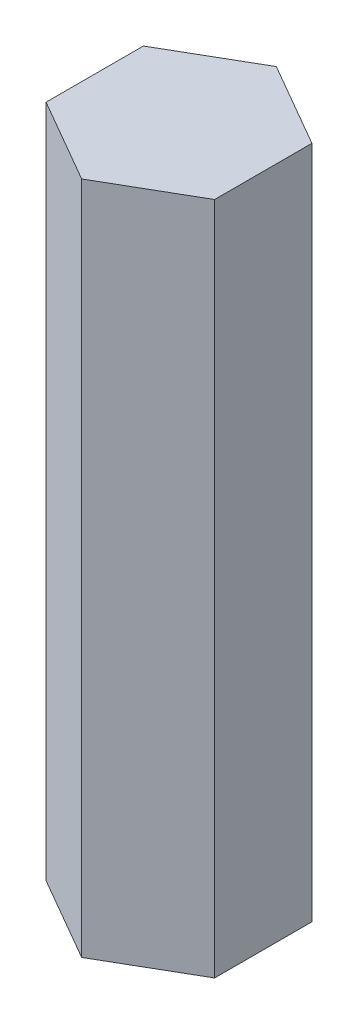
ISO-10303-21;
HEADER;
FILE_DESCRIPTION(('STEP AP214'),'2;1');
FILE_NAME('part.step','',(''),(''),'','','');
FILE_SCHEMA(('AUTOMOTIVE_DESIGN { 1 0 10303 214 1 1 1 1 }'));
ENDSEC;
DATA;
#1=APPLICATION_CONTEXT('core data for automotive mechanical design processes');
#2=APPLICATION_PROTOCOL_DEFINITION('international standard','automotive_design',2000,#1);
#3=PRODUCT_CONTEXT('',#1,'mechanical');
#4=PRODUCT('Part','Part','',(#3));
#5=PRODUCT_RELATED_PRODUCT_CATEGORY('part','',(#4));
#6=PRODUCT_DEFINITION_FORMATION('','',#4);
#7=PRODUCT_DEFINITION_CONTEXT('part definition',#1,'design');
#8=PRODUCT_DEFINITION('design','',#6,#7);
#9=PRODUCT_DEFINITION_SHAPE('','',#8);
#10=(LENGTH_UNIT() NAMED_UNIT(*) SI_UNIT(.MILLI.,.METRE.));
#11=(NAMED_UNIT(*) PLANE_ANGLE_UNIT() SI_UNIT($,.RADIAN.));
#12=(NAMED_UNIT(*) SI_UNIT($,.STERADIAN.) SOLID_ANGLE_UNIT());
#13=UNCERTAINTY_MEASURE_WITH_UNIT(LENGTH_MEASURE(1.E-05),#10,'distance_accuracy_value','');
#14=(GEOMETRIC_REPRESENTATION_CONTEXT(3) GLOBAL_UNCERTAINTY_ASSIGNED_CONTEXT((#13)) GLOBAL_UNIT_ASSIGNED_CONTEXT((#10,
#11,#12)) REPRESENTATION_CONTEXT('',''));
#15=CARTESIAN_POINT('',(0.,0.,0.));
#16=DIRECTION('',(0.,0.,1.));
#17=DIRECTION('',(1.,0.,0.));
#18=AXIS2_PLACEMENT_3D('',#15,#16,#17);
#19=CARTESIAN_POINT('',(6.34999999999995,50.8,-3.66617420935419));
#20=DIRECTION('',(-0.499999999999995,0.,0.866025403784441));
#21=DIRECTION('',(0.866025403784441,0.,0.499999999999995));
#22=AXIS2_PLACEMENT_3D('',#19,#20,#21);
#23=PLANE('',#22);
#24=DIRECTION('',(-0.866025403784441,0.,-0.499999999999995));
#25=VECTOR('',#24,1.);
#26=CARTESIAN_POINT('',(6.34999999999995,0.,-3.66617420935419));
#27=LINE('',#26,#25);
#28=CARTESIAN_POINT('',(6.34999999999995,0.,-3.66617420935419));
#29=VERTEX_POINT('',#28);
#30=CARTESIAN_POINT('',(0.,0.,-7.33234841870824));
#31=VERTEX_POINT('',#30);
#32=EDGE_CURVE('E121',#29,#31,#27,.T.);
#33=ORIENTED_EDGE('',*,*,#32,.T.);
#34=DIRECTION('',(0.,-1.,0.));
#35=VECTOR('',#34,1.);
#36=CARTESIAN_POINT('',(0.,50.8,-7.33234841870824));
#37=LINE('',#36,#35);
#38=CARTESIAN_POINT('',(0.,50.8,-7.33234841870824));
#39=VERTEX_POINT('',#38);
#40=EDGE_CURVE('E11',#39,#31,#37,.T.);
#41=ORIENTED_EDGE('',*,*,#40,.F.);
#42=DIRECTION('',(-0.866025403784441,0.,-0.499999999999995));
#43=VECTOR('',#42,1.);
#44=CARTESIAN_POINT('',(6.34999999999995,50.8,-3.66617420935419));
#45=LINE('',#44,#43);
#46=CARTESIAN_POINT('',(6.34999999999995,50.8,-3.66617420935419));
#47=VERTEX_POINT('',#46);
#48=EDGE_CURVE('E133',#47,#39,#45,.T.);
#49=ORIENTED_EDGE('',*,*,#48,.F.);
#50=DIRECTION('',(0.,-1.,0.));
#51=VECTOR('',#50,1.);
#52=CARTESIAN_POINT('',(6.34999999999995,50.8,-3.66617420935419));
#53=LINE('',#52,#51);
#54=EDGE_CURVE('E118',#47,#29,#53,.T.);
#55=ORIENTED_EDGE('',*,*,#54,.T.);
#56=EDGE_LOOP('',(#33,#41,#49,#55));
#57=FACE_BOUND('',#56,.T.);
#58=ADVANCED_FACE('F39',(#57),#23,.F.);
#59=CARTESIAN_POINT('',(0.,50.8,-7.33234841870824));
#60=DIRECTION('',(0.500000000000001,0.,0.866025403784438));
#61=DIRECTION('',(0.866025403784438,0.,-0.500000000000001));
#62=AXIS2_PLACEMENT_3D('',#59,#60,#61);
#63=PLANE('',#62);
#64=DIRECTION('',(-0.866025403784438,0.,0.500000000000001));
#65=VECTOR('',#64,1.);
#66=CARTESIAN_POINT('',(0.,0.,-7.33234841870824));
#67=LINE('',#66,#65);
#68=CARTESIAN_POINT('',(-6.35,0.,-3.6661742093541));
#69=VERTEX_POINT('',#68);
#70=EDGE_CURVE('E128',#31,#69,#67,.T.);
#71=ORIENTED_EDGE('',*,*,#70,.T.);
#72=DIRECTION('',(0.,-1.,0.));
#73=VECTOR('',#72,1.);
#74=CARTESIAN_POINT('',(-6.35,50.8,-3.6661742093541));
#75=LINE('',#74,#73);
#76=CARTESIAN_POINT('',(-6.35,50.8,-3.6661742093541));
#77=VERTEX_POINT('',#76);
#78=EDGE_CURVE('E50',#77,#69,#75,.T.);
#79=ORIENTED_EDGE('',*,*,#78,.F.);
#80=DIRECTION('',(-0.866025403784438,0.,0.500000000000001));
#81=VECTOR('',#80,1.);
#82=CARTESIAN_POINT('',(0.,50.8,-7.33234841870824));
#83=LINE('',#82,#81);
#84=EDGE_CURVE('E95',#39,#77,#83,.T.);
#85=ORIENTED_EDGE('',*,*,#84,.F.);
#86=ORIENTED_EDGE('',*,*,#40,.T.);
#87=EDGE_LOOP('',(#71,#79,#85,#86));
#88=FACE_BOUND('',#87,.T.);
#89=ADVANCED_FACE('F160',(#88),#63,.F.);
#90=CARTESIAN_POINT('',(-6.35,50.8,-3.6661742093541));
#91=DIRECTION('',(1.,0.,0.));
#92=DIRECTION('',(0.,0.,-1.));
#93=AXIS2_PLACEMENT_3D('',#90,#91,#92);
#94=PLANE('',#93);
#95=DIRECTION('',(0.,0.,1.));
#96=VECTOR('',#95,1.);
#97=CARTESIAN_POINT('',(-6.35,0.,-3.6661742093541));
#98=LINE('',#97,#96);
#99=CARTESIAN_POINT('',(-6.34999999999998,0.,3.66617420935415));
#100=VERTEX_POINT('',#99);
#101=EDGE_CURVE('E126',#69,#100,#98,.T.);
#102=ORIENTED_EDGE('',*,*,#101,.T.);
#103=DIRECTION('',(0.,-1.,0.));
#104=VECTOR('',#103,1.);
#105=CARTESIAN_POINT('',(-6.34999999999998,50.8,3.66617420935415));
#106=LINE('',#105,#104);
#107=CARTESIAN_POINT('',(-6.34999999999998,50.8,3.66617420935415));
#108=VERTEX_POINT('',#107);
#109=EDGE_CURVE('E114',#108,#100,#106,.T.);
#110=ORIENTED_EDGE('',*,*,#109,.F.);
#111=DIRECTION('',(0.,0.,1.));
#112=VECTOR('',#111,1.);
#113=CARTESIAN_POINT('',(-6.35,50.8,-3.6661742093541));
#114=LINE('',#113,#112);
#115=EDGE_CURVE('E103',#77,#108,#114,.T.);
#116=ORIENTED_EDGE('',*,*,#115,.F.);
#117=ORIENTED_EDGE('',*,*,#78,.T.);
#118=EDGE_LOOP('',(#102,#110,#116,#117));
#119=FACE_BOUND('',#118,.T.);
#120=ADVANCED_FACE('F137',(#119),#94,.F.);
#121=CARTESIAN_POINT('',(-6.34999999999998,50.8,3.66617420935415));
#122=DIRECTION('',(0.499999999999995,0.,-0.866025403784442));
#123=DIRECTION('',(-0.866025403784442,0.,-0.499999999999995));
#124=AXIS2_PLACEMENT_3D('',#121,#122,#123);
#125=PLANE('',#124);
#126=DIRECTION('',(0.866025403784442,0.,0.499999999999995));
#127=VECTOR('',#126,1.);
#128=CARTESIAN_POINT('',(-6.34999999999998,0.,3.66617420935415));
#129=LINE('',#128,#127);
#130=CARTESIAN_POINT('',(0.,0.,7.33234841870824));
#131=VERTEX_POINT('',#130);
#132=EDGE_CURVE('E111',#100,#131,#129,.T.);
#133=ORIENTED_EDGE('',*,*,#132,.T.);
#134=DIRECTION('',(0.,-1.,0.));
#135=VECTOR('',#134,1.);
#136=CARTESIAN_POINT('',(0.,50.8,7.33234841870824));
#137=LINE('',#136,#135);
#138=CARTESIAN_POINT('',(0.,50.8,7.33234841870824));
#139=VERTEX_POINT('',#138);
#140=EDGE_CURVE('E110',#139,#131,#137,.T.);
#141=ORIENTED_EDGE('',*,*,#140,.F.);
#142=DIRECTION('',(0.866025403784442,0.,0.499999999999995));
#143=VECTOR('',#142,1.);
#144=CARTESIAN_POINT('',(-6.34999999999998,50.8,3.66617420935415));
#145=LINE('',#144,#143);
#146=EDGE_CURVE('E98',#108,#139,#145,.T.);
#147=ORIENTED_EDGE('',*,*,#146,.F.);
#148=ORIENTED_EDGE('',*,*,#109,.T.);
#149=EDGE_LOOP('',(#133,#141,#147,#148));
#150=FACE_BOUND('',#149,.T.);
#151=ADVANCED_FACE('F112',(#150),#125,.F.);
#152=CARTESIAN_POINT('',(0.,50.8,7.33234841870824));
#153=DIRECTION('',(-0.500000000000007,0.,-0.866025403784435));
#154=DIRECTION('',(-0.866025403784435,0.,0.500000000000007));
#155=AXIS2_PLACEMENT_3D('',#152,#153,#154);
#156=PLANE('',#155);
#157=DIRECTION('',(0.866025403784434,0.,-0.500000000000007));
#158=VECTOR('',#157,1.);
#159=CARTESIAN_POINT('',(0.,0.,7.33234841870824));
#160=LINE('',#159,#158);
#161=CARTESIAN_POINT('',(6.35000000000003,0.,3.66617420935406));
#162=VERTEX_POINT('',#161);
#163=EDGE_CURVE('E76',#131,#162,#160,.T.);
#164=ORIENTED_EDGE('',*,*,#163,.T.);
#165=DIRECTION('',(0.,-1.,0.));
#166=VECTOR('',#165,1.);
#167=CARTESIAN_POINT('',(6.35000000000003,50.8,3.66617420935406));
#168=LINE('',#167,#166);
#169=CARTESIAN_POINT('',(6.35000000000003,50.8,3.66617420935406));
#170=VERTEX_POINT('',#169);
#171=EDGE_CURVE('E113',#170,#162,#168,.T.);
#172=ORIENTED_EDGE('',*,*,#171,.F.);
#173=DIRECTION('',(0.866025403784434,0.,-0.500000000000007));
#174=VECTOR('',#173,1.);
#175=CARTESIAN_POINT('',(0.,50.8,7.33234841870824));
#176=LINE('',#175,#174);
#177=EDGE_CURVE('E104',#139,#170,#176,.T.);
#178=ORIENTED_EDGE('',*,*,#177,.F.);
#179=ORIENTED_EDGE('',*,*,#140,.T.);
#180=EDGE_LOOP('',(#164,#172,#178,#179));
#181=FACE_BOUND('',#180,.T.);
#182=ADVANCED_FACE('F117',(#181),#156,.F.);
#183=CARTESIAN_POINT('',(6.35000000000003,50.8,3.66617420935406));
#184=DIRECTION('',(-1.,0.,0.));
#185=DIRECTION('',(0.,0.,1.));
#186=AXIS2_PLACEMENT_3D('',#183,#184,#185);
#187=PLANE('',#186);
#188=DIRECTION('',(0.,0.,-1.));
#189=VECTOR('',#188,1.);
#190=CARTESIAN_POINT('',(6.35000000000003,0.,3.66617420935406));
#191=LINE('',#190,#189);
#192=EDGE_CURVE('E84',#162,#29,#191,.T.);
#193=ORIENTED_EDGE('',*,*,#192,.T.);
#194=ORIENTED_EDGE('',*,*,#54,.F.);
#195=DIRECTION('',(0.,0.,-1.));
#196=VECTOR('',#195,1.);
#197=CARTESIAN_POINT('',(6.35000000000003,50.8,3.66617420935406));
#198=LINE('',#197,#196);
#199=EDGE_CURVE('E54',#170,#47,#198,.T.);
#200=ORIENTED_EDGE('',*,*,#199,.F.);
#201=ORIENTED_EDGE('',*,*,#171,.T.);
#202=EDGE_LOOP('',(#193,#194,#200,#201));
#203=FACE_BOUND('',#202,.T.);
#204=ADVANCED_FACE('F147',(#203),#187,.F.);
#205=CARTESIAN_POINT('',(0.,50.8,0.));
#206=DIRECTION('',(0.,1.,0.));
#207=DIRECTION('',(0.,0.,1.));
#208=AXIS2_PLACEMENT_3D('',#205,#206,#207);
#209=PLANE('',#208);
#210=ORIENTED_EDGE('',*,*,#48,.T.);
#211=ORIENTED_EDGE('',*,*,#84,.T.);
#212=ORIENTED_EDGE('',*,*,#115,.T.);
#213=ORIENTED_EDGE('',*,*,#146,.T.);
#214=ORIENTED_EDGE('',*,*,#177,.T.);
#215=ORIENTED_EDGE('',*,*,#199,.T.);
#216=EDGE_LOOP('',(#210,#211,#212,#213,#214,#215));
#217=FACE_BOUND('',#216,.T.);
#218=ADVANCED_FACE('F102',(#217),#209,.T.);
#219=CARTESIAN_POINT('',(0.,0.,0.));
#220=DIRECTION('',(0.,1.,0.));
#221=DIRECTION('',(0.,0.,1.));
#222=AXIS2_PLACEMENT_3D('',#219,#220,#221);
#223=PLANE('',#222);
#224=ORIENTED_EDGE('',*,*,#32,.F.);
#225=ORIENTED_EDGE('',*,*,#192,.F.);
#226=ORIENTED_EDGE('',*,*,#163,.F.);
#227=ORIENTED_EDGE('',*,*,#132,.F.);
#228=ORIENTED_EDGE('',*,*,#101,.F.);
#229=ORIENTED_EDGE('',*,*,#70,.F.);
#230=EDGE_LOOP('',(#224,#225,#226,#227,#228,#229));
#231=FACE_BOUND('',#230,.T.);
#232=ADVANCED_FACE('F145',(#231),#223,.F.);
#233=CLOSED_SHELL('',(#58,#89,#120,#151,#182,#204,#218,#232));
#234=MANIFOLD_SOLID_BREP('B2',#233);
#235=ADVANCED_BREP_SHAPE_REPRESENTATION('',(#18,#234),#14);
#236=SHAPE_DEFINITION_REPRESENTATION(#9,#235);
ENDSEC;
END-ISO-10303-21;
